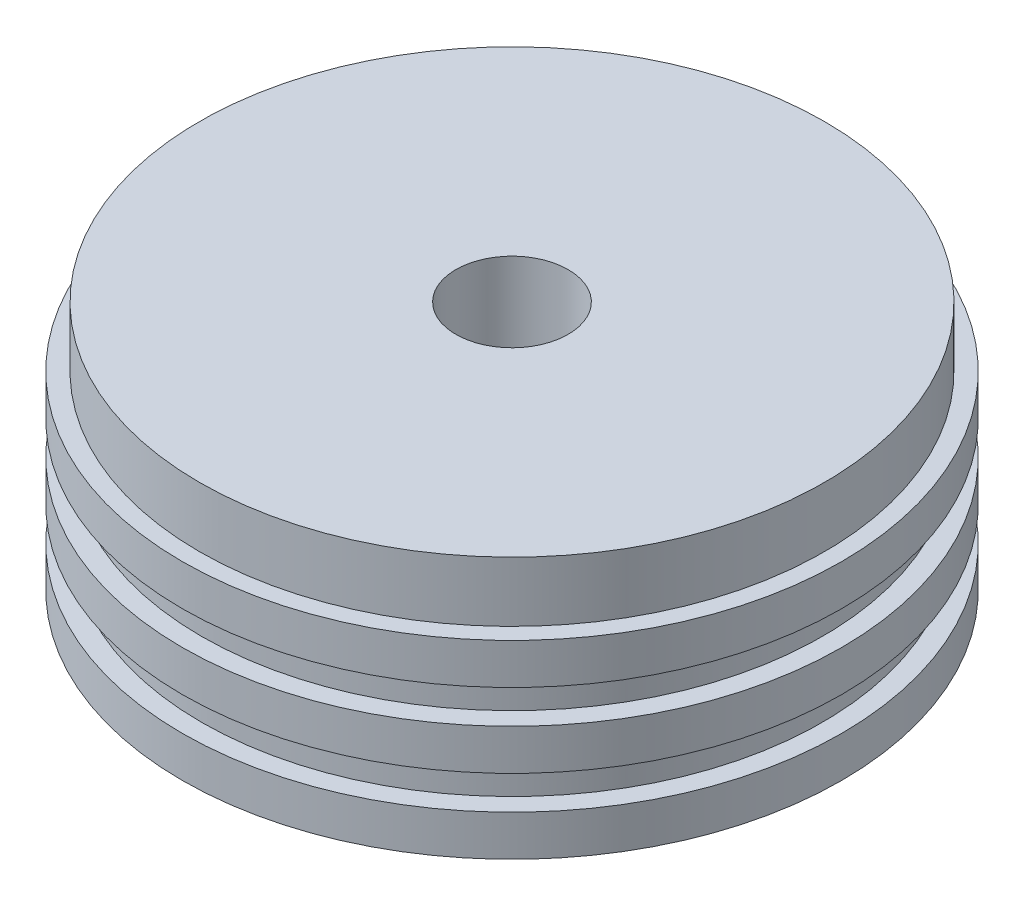
ISO-10303-21;
HEADER;
FILE_DESCRIPTION(('STEP AP214'),'2;1');
FILE_NAME('part.step','',(''),(''),'','','');
FILE_SCHEMA(('AUTOMOTIVE_DESIGN { 1 0 10303 214 1 1 1 1 }'));
ENDSEC;
DATA;
#1=APPLICATION_CONTEXT('core data for automotive mechanical design processes');
#2=APPLICATION_PROTOCOL_DEFINITION('international standard','automotive_design',2000,#1);
#3=PRODUCT_CONTEXT('',#1,'mechanical');
#4=PRODUCT('Part','Part','',(#3));
#5=PRODUCT_RELATED_PRODUCT_CATEGORY('part','',(#4));
#6=PRODUCT_DEFINITION_FORMATION('','',#4);
#7=PRODUCT_DEFINITION_CONTEXT('part definition',#1,'design');
#8=PRODUCT_DEFINITION('design','',#6,#7);
#9=PRODUCT_DEFINITION_SHAPE('','',#8);
#10=(LENGTH_UNIT() NAMED_UNIT(*) SI_UNIT(.MILLI.,.METRE.));
#11=(NAMED_UNIT(*) PLANE_ANGLE_UNIT() SI_UNIT($,.RADIAN.));
#12=(NAMED_UNIT(*) SI_UNIT($,.STERADIAN.) SOLID_ANGLE_UNIT());
#13=UNCERTAINTY_MEASURE_WITH_UNIT(LENGTH_MEASURE(1.E-05),#10,'distance_accuracy_value','');
#14=(GEOMETRIC_REPRESENTATION_CONTEXT(3) GLOBAL_UNCERTAINTY_ASSIGNED_CONTEXT((#13)) GLOBAL_UNIT_ASSIGNED_CONTEXT((#10,
#11,#12)) REPRESENTATION_CONTEXT('',''));
#15=CARTESIAN_POINT('',(0.,0.,0.));
#16=DIRECTION('',(0.,0.,1.));
#17=DIRECTION('',(1.,0.,0.));
#18=AXIS2_PLACEMENT_3D('',#15,#16,#17);
#19=CARTESIAN_POINT('',(-34.8996,0.,0.));
#20=DIRECTION('',(0.,1.,0.));
#21=DIRECTION('',(0.,0.,1.));
#22=AXIS2_PLACEMENT_3D('',#19,#20,#21);
#23=PLANE('',#22);
#24=CARTESIAN_POINT('',(0.,0.,0.));
#25=DIRECTION('',(0.,-1.,0.));
#26=DIRECTION('',(0.,0.,-1.));
#27=AXIS2_PLACEMENT_3D('',#24,#25,#26);
#28=CIRCLE('',#27,5.94359999999999);
#29=CARTESIAN_POINT('',(0.,0.,-5.94359999999999));
#30=VERTEX_POINT('',#29);
#31=EDGE_CURVE('E84',#30,#30,#28,.T.);
#32=ORIENTED_EDGE('',*,*,#31,.F.);
#33=EDGE_LOOP('',(#32));
#34=FACE_BOUND('',#33,.T.);
#35=CARTESIAN_POINT('',(0.,0.,0.));
#36=DIRECTION('',(0.,-1.,0.));
#37=DIRECTION('',(0.,0.,-1.));
#38=AXIS2_PLACEMENT_3D('',#35,#36,#37);
#39=CIRCLE('',#38,34.8996);
#40=CARTESIAN_POINT('',(0.,0.,-34.8996));
#41=VERTEX_POINT('',#40);
#42=EDGE_CURVE('E78',#41,#41,#39,.T.);
#43=ORIENTED_EDGE('',*,*,#42,.T.);
#44=EDGE_LOOP('',(#43));
#45=FACE_BOUND('',#44,.T.);
#46=ADVANCED_FACE('F38',(#34,#45),#23,.F.);
#47=CARTESIAN_POINT('',(0.,26.416,0.));
#48=DIRECTION('',(0.,-1.,0.));
#49=DIRECTION('',(0.,0.,-1.));
#50=AXIS2_PLACEMENT_3D('',#47,#48,#49);
#51=PLANE('',#50);
#52=CARTESIAN_POINT('',(0.,26.416,0.));
#53=DIRECTION('',(0.,-1.,0.));
#54=DIRECTION('',(0.,0.,-1.));
#55=AXIS2_PLACEMENT_3D('',#52,#53,#54);
#56=CIRCLE('',#55,5.94359999999999);
#57=CARTESIAN_POINT('',(0.,26.416,-5.94359999999999));
#58=VERTEX_POINT('',#57);
#59=EDGE_CURVE('E81',#58,#58,#56,.T.);
#60=ORIENTED_EDGE('',*,*,#59,.T.);
#61=EDGE_LOOP('',(#60));
#62=FACE_BOUND('',#61,.T.);
#63=CARTESIAN_POINT('',(0.,26.416,0.));
#64=DIRECTION('',(0.,-1.,0.));
#65=DIRECTION('',(0.,0.,-1.));
#66=AXIS2_PLACEMENT_3D('',#63,#64,#65);
#67=CIRCLE('',#66,33.0835);
#68=CARTESIAN_POINT('',(0.,26.416,-33.0835));
#69=VERTEX_POINT('',#68);
#70=EDGE_CURVE('E10',#69,#69,#67,.T.);
#71=ORIENTED_EDGE('',*,*,#70,.F.);
#72=EDGE_LOOP('',(#71));
#73=FACE_BOUND('',#72,.T.);
#74=ADVANCED_FACE('F92',(#62,#73),#51,.F.);
#75=CARTESIAN_POINT('',(0.,0.,0.));
#76=DIRECTION('',(0.,-1.,0.));
#77=DIRECTION('',(0.,0.,-1.));
#78=AXIS2_PLACEMENT_3D('',#75,#76,#77);
#79=CYLINDRICAL_SURFACE('',#78,33.0835);
#80=CARTESIAN_POINT('',(0.,20.066,0.));
#81=DIRECTION('',(0.,-1.,0.));
#82=DIRECTION('',(0.,0.,-1.));
#83=AXIS2_PLACEMENT_3D('',#80,#81,#82);
#84=CIRCLE('',#83,33.0835);
#85=CARTESIAN_POINT('',(0.,20.066,-33.0835));
#86=VERTEX_POINT('',#85);
#87=EDGE_CURVE('E44',#86,#86,#84,.T.);
#88=ORIENTED_EDGE('',*,*,#87,.F.);
#89=EDGE_LOOP('',(#88));
#90=FACE_BOUND('',#89,.T.);
#91=ORIENTED_EDGE('',*,*,#70,.T.);
#92=EDGE_LOOP('',(#91));
#93=FACE_BOUND('',#92,.T.);
#94=ADVANCED_FACE('F151',(#90,#93),#79,.T.);
#95=CARTESIAN_POINT('',(-33.0835,20.066,0.));
#96=DIRECTION('',(0.,-1.,0.));
#97=DIRECTION('',(0.,0.,-1.));
#98=AXIS2_PLACEMENT_3D('',#95,#96,#97);
#99=PLANE('',#98);
#100=CARTESIAN_POINT('',(0.,20.066,0.));
#101=DIRECTION('',(0.,-1.,0.));
#102=DIRECTION('',(0.,0.,-1.));
#103=AXIS2_PLACEMENT_3D('',#100,#101,#102);
#104=CIRCLE('',#103,34.8996);
#105=CARTESIAN_POINT('',(0.,20.066,-34.8996));
#106=VERTEX_POINT('',#105);
#107=EDGE_CURVE('E48',#106,#106,#104,.T.);
#108=ORIENTED_EDGE('',*,*,#107,.F.);
#109=EDGE_LOOP('',(#108));
#110=FACE_BOUND('',#109,.T.);
#111=ORIENTED_EDGE('',*,*,#87,.T.);
#112=EDGE_LOOP('',(#111));
#113=FACE_BOUND('',#112,.T.);
#114=ADVANCED_FACE('F146',(#110,#113),#99,.F.);
#115=CARTESIAN_POINT('',(0.,0.,0.));
#116=DIRECTION('',(0.,-1.,0.));
#117=DIRECTION('',(0.,0.,-1.));
#118=AXIS2_PLACEMENT_3D('',#115,#116,#117);
#119=CYLINDRICAL_SURFACE('',#118,34.8996);
#120=CARTESIAN_POINT('',(0.,15.748,0.));
#121=DIRECTION('',(0.,-1.,0.));
#122=DIRECTION('',(0.,0.,-1.));
#123=AXIS2_PLACEMENT_3D('',#120,#121,#122);
#124=CIRCLE('',#123,34.8996);
#125=CARTESIAN_POINT('',(0.,15.748,-34.8996));
#126=VERTEX_POINT('',#125);
#127=EDGE_CURVE('E52',#126,#126,#124,.T.);
#128=ORIENTED_EDGE('',*,*,#127,.F.);
#129=EDGE_LOOP('',(#128));
#130=FACE_BOUND('',#129,.T.);
#131=ORIENTED_EDGE('',*,*,#107,.T.);
#132=EDGE_LOOP('',(#131));
#133=FACE_BOUND('',#132,.T.);
#134=ADVANCED_FACE('F140',(#130,#133),#119,.T.);
#135=CARTESIAN_POINT('',(-34.8996,15.748,0.));
#136=DIRECTION('',(0.,1.,0.));
#137=DIRECTION('',(0.,0.,1.));
#138=AXIS2_PLACEMENT_3D('',#135,#136,#137);
#139=PLANE('',#138);
#140=CARTESIAN_POINT('',(0.,15.748,0.));
#141=DIRECTION('',(0.,-1.,0.));
#142=DIRECTION('',(0.,0.,-1.));
#143=AXIS2_PLACEMENT_3D('',#140,#141,#142);
#144=CIRCLE('',#143,32.8676);
#145=CARTESIAN_POINT('',(0.,15.748,-32.8676));
#146=VERTEX_POINT('',#145);
#147=EDGE_CURVE('E57',#146,#146,#144,.T.);
#148=ORIENTED_EDGE('',*,*,#147,.F.);
#149=EDGE_LOOP('',(#148));
#150=FACE_BOUND('',#149,.T.);
#151=ORIENTED_EDGE('',*,*,#127,.T.);
#152=EDGE_LOOP('',(#151));
#153=FACE_BOUND('',#152,.T.);
#154=ADVANCED_FACE('F134',(#150,#153),#139,.F.);
#155=CARTESIAN_POINT('',(0.,0.,0.));
#156=DIRECTION('',(0.,-1.,0.));
#157=DIRECTION('',(0.,0.,-1.));
#158=AXIS2_PLACEMENT_3D('',#155,#156,#157);
#159=CYLINDRICAL_SURFACE('',#158,32.8676);
#160=CARTESIAN_POINT('',(0.,12.192,0.));
#161=DIRECTION('',(0.,-1.,0.));
#162=DIRECTION('',(0.,0.,-1.));
#163=AXIS2_PLACEMENT_3D('',#160,#161,#162);
#164=CIRCLE('',#163,32.8676);
#165=CARTESIAN_POINT('',(0.,12.192,-32.8676));
#166=VERTEX_POINT('',#165);
#167=EDGE_CURVE('E60',#166,#166,#164,.T.);
#168=ORIENTED_EDGE('',*,*,#167,.F.);
#169=EDGE_LOOP('',(#168));
#170=FACE_BOUND('',#169,.T.);
#171=ORIENTED_EDGE('',*,*,#147,.T.);
#172=EDGE_LOOP('',(#171));
#173=FACE_BOUND('',#172,.T.);
#174=ADVANCED_FACE('F128',(#170,#173),#159,.T.);
#175=CARTESIAN_POINT('',(-34.8996,12.192,0.));
#176=DIRECTION('',(0.,-1.,0.));
#177=DIRECTION('',(0.,0.,-1.));
#178=AXIS2_PLACEMENT_3D('',#175,#176,#177);
#179=PLANE('',#178);
#180=CARTESIAN_POINT('',(0.,12.192,0.));
#181=DIRECTION('',(0.,-1.,0.));
#182=DIRECTION('',(0.,0.,-1.));
#183=AXIS2_PLACEMENT_3D('',#180,#181,#182);
#184=CIRCLE('',#183,34.8996);
#185=CARTESIAN_POINT('',(0.,12.192,-34.8996));
#186=VERTEX_POINT('',#185);
#187=EDGE_CURVE('E63',#186,#186,#184,.T.);
#188=ORIENTED_EDGE('',*,*,#187,.F.);
#189=EDGE_LOOP('',(#188));
#190=FACE_BOUND('',#189,.T.);
#191=ORIENTED_EDGE('',*,*,#167,.T.);
#192=EDGE_LOOP('',(#191));
#193=FACE_BOUND('',#192,.T.);
#194=ADVANCED_FACE('F122',(#190,#193),#179,.F.);
#195=CARTESIAN_POINT('',(0.,0.,0.));
#196=DIRECTION('',(0.,-1.,0.));
#197=DIRECTION('',(0.,0.,-1.));
#198=AXIS2_PLACEMENT_3D('',#195,#196,#197);
#199=CYLINDRICAL_SURFACE('',#198,34.8996);
#200=CARTESIAN_POINT('',(0.,7.874,0.));
#201=DIRECTION('',(0.,-1.,0.));
#202=DIRECTION('',(0.,0.,-1.));
#203=AXIS2_PLACEMENT_3D('',#200,#201,#202);
#204=CIRCLE('',#203,34.8996);
#205=CARTESIAN_POINT('',(0.,7.874,-34.8996));
#206=VERTEX_POINT('',#205);
#207=EDGE_CURVE('E66',#206,#206,#204,.T.);
#208=ORIENTED_EDGE('',*,*,#207,.F.);
#209=EDGE_LOOP('',(#208));
#210=FACE_BOUND('',#209,.T.);
#211=ORIENTED_EDGE('',*,*,#187,.T.);
#212=EDGE_LOOP('',(#211));
#213=FACE_BOUND('',#212,.T.);
#214=ADVANCED_FACE('F116',(#210,#213),#199,.T.);
#215=CARTESIAN_POINT('',(-32.8676,7.874,0.));
#216=DIRECTION('',(0.,1.,0.));
#217=DIRECTION('',(0.,0.,1.));
#218=AXIS2_PLACEMENT_3D('',#215,#216,#217);
#219=PLANE('',#218);
#220=CARTESIAN_POINT('',(0.,7.874,0.));
#221=DIRECTION('',(0.,-1.,0.));
#222=DIRECTION('',(0.,0.,-1.));
#223=AXIS2_PLACEMENT_3D('',#220,#221,#222);
#224=CIRCLE('',#223,32.8676);
#225=CARTESIAN_POINT('',(0.,7.874,-32.8676));
#226=VERTEX_POINT('',#225);
#227=EDGE_CURVE('E69',#226,#226,#224,.T.);
#228=ORIENTED_EDGE('',*,*,#227,.F.);
#229=EDGE_LOOP('',(#228));
#230=FACE_BOUND('',#229,.T.);
#231=ORIENTED_EDGE('',*,*,#207,.T.);
#232=EDGE_LOOP('',(#231));
#233=FACE_BOUND('',#232,.T.);
#234=ADVANCED_FACE('F110',(#230,#233),#219,.F.);
#235=CARTESIAN_POINT('',(0.,0.,0.));
#236=DIRECTION('',(0.,-1.,0.));
#237=DIRECTION('',(0.,0.,-1.));
#238=AXIS2_PLACEMENT_3D('',#235,#236,#237);
#239=CYLINDRICAL_SURFACE('',#238,32.8676);
#240=CARTESIAN_POINT('',(0.,4.318,0.));
#241=DIRECTION('',(0.,-1.,0.));
#242=DIRECTION('',(0.,0.,-1.));
#243=AXIS2_PLACEMENT_3D('',#240,#241,#242);
#244=CIRCLE('',#243,32.8676);
#245=CARTESIAN_POINT('',(0.,4.318,-32.8676));
#246=VERTEX_POINT('',#245);
#247=EDGE_CURVE('E72',#246,#246,#244,.T.);
#248=ORIENTED_EDGE('',*,*,#247,.F.);
#249=EDGE_LOOP('',(#248));
#250=FACE_BOUND('',#249,.T.);
#251=ORIENTED_EDGE('',*,*,#227,.T.);
#252=EDGE_LOOP('',(#251));
#253=FACE_BOUND('',#252,.T.);
#254=ADVANCED_FACE('F104',(#250,#253),#239,.T.);
#255=CARTESIAN_POINT('',(-32.8676,4.318,0.));
#256=DIRECTION('',(0.,-1.,0.));
#257=DIRECTION('',(0.,0.,-1.));
#258=AXIS2_PLACEMENT_3D('',#255,#256,#257);
#259=PLANE('',#258);
#260=CARTESIAN_POINT('',(0.,4.318,0.));
#261=DIRECTION('',(0.,-1.,0.));
#262=DIRECTION('',(0.,0.,-1.));
#263=AXIS2_PLACEMENT_3D('',#260,#261,#262);
#264=CIRCLE('',#263,34.8996);
#265=CARTESIAN_POINT('',(0.,4.318,-34.8996));
#266=VERTEX_POINT('',#265);
#267=EDGE_CURVE('E75',#266,#266,#264,.T.);
#268=ORIENTED_EDGE('',*,*,#267,.F.);
#269=EDGE_LOOP('',(#268));
#270=FACE_BOUND('',#269,.T.);
#271=ORIENTED_EDGE('',*,*,#247,.T.);
#272=EDGE_LOOP('',(#271));
#273=FACE_BOUND('',#272,.T.);
#274=ADVANCED_FACE('F98',(#270,#273),#259,.F.);
#275=CARTESIAN_POINT('',(0.,0.,0.));
#276=DIRECTION('',(0.,-1.,0.));
#277=DIRECTION('',(0.,0.,-1.));
#278=AXIS2_PLACEMENT_3D('',#275,#276,#277);
#279=CYLINDRICAL_SURFACE('',#278,34.8996);
#280=ORIENTED_EDGE('',*,*,#42,.F.);
#281=EDGE_LOOP('',(#280));
#282=FACE_BOUND('',#281,.T.);
#283=ORIENTED_EDGE('',*,*,#267,.T.);
#284=EDGE_LOOP('',(#283));
#285=FACE_BOUND('',#284,.T.);
#286=ADVANCED_FACE('F95',(#282,#285),#279,.T.);
#287=CARTESIAN_POINT('',(0.,0.,0.));
#288=DIRECTION('',(0.,-1.,0.));
#289=DIRECTION('',(0.,0.,-1.));
#290=AXIS2_PLACEMENT_3D('',#287,#288,#289);
#291=CYLINDRICAL_SURFACE('',#290,5.94359999999999);
#292=ORIENTED_EDGE('',*,*,#59,.F.);
#293=EDGE_LOOP('',(#292));
#294=FACE_BOUND('',#293,.T.);
#295=ORIENTED_EDGE('',*,*,#31,.T.);
#296=EDGE_LOOP('',(#295));
#297=FACE_BOUND('',#296,.T.);
#298=ADVANCED_FACE('F88',(#294,#297),#291,.F.);
#299=CLOSED_SHELL('',(#46,#74,#94,#114,#134,#154,#174,#194,#214,#234,#254,#274,#286,#298));
#300=MANIFOLD_SOLID_BREP('B2',#299);
#301=ADVANCED_BREP_SHAPE_REPRESENTATION('',(#18,#300),#14);
#302=SHAPE_DEFINITION_REPRESENTATION(#9,#301);
ENDSEC;
END-ISO-10303-21;
